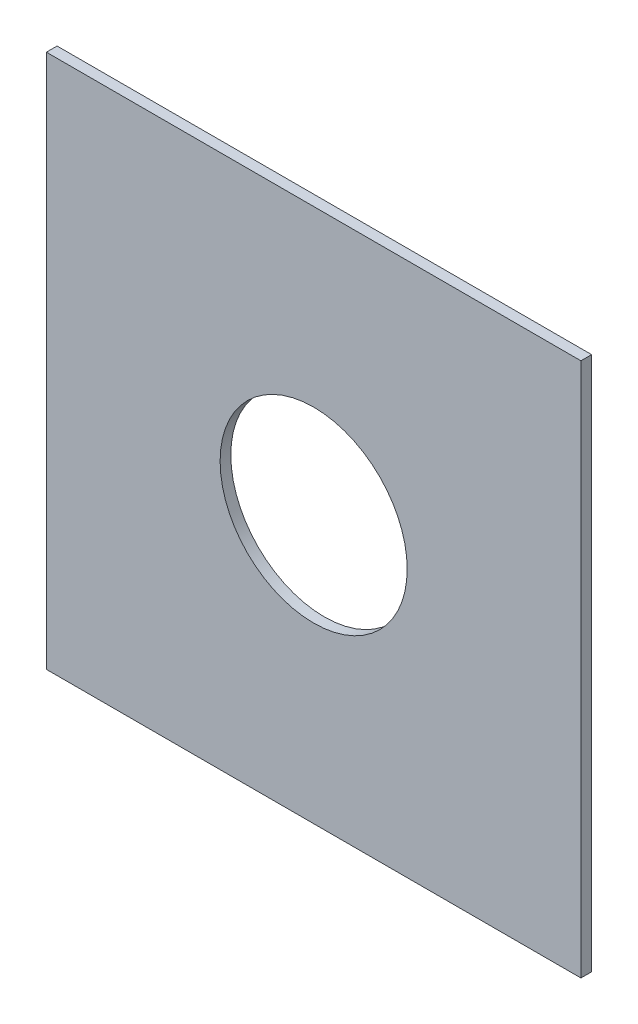
ISO-10303-21;
HEADER;
FILE_DESCRIPTION(('STEP AP214'),'2;1');
FILE_NAME('part.step','',(''),(''),'','','');
FILE_SCHEMA(('AUTOMOTIVE_DESIGN { 1 0 10303 214 1 1 1 1 }'));
ENDSEC;
DATA;
#1=APPLICATION_CONTEXT('core data for automotive mechanical design processes');
#2=APPLICATION_PROTOCOL_DEFINITION('international standard','automotive_design',2000,#1);
#3=PRODUCT_CONTEXT('',#1,'mechanical');
#4=PRODUCT('Part','Part','',(#3));
#5=PRODUCT_RELATED_PRODUCT_CATEGORY('part','',(#4));
#6=PRODUCT_DEFINITION_FORMATION('','',#4);
#7=PRODUCT_DEFINITION_CONTEXT('part definition',#1,'design');
#8=PRODUCT_DEFINITION('design','',#6,#7);
#9=PRODUCT_DEFINITION_SHAPE('','',#8);
#10=(LENGTH_UNIT() NAMED_UNIT(*) SI_UNIT(.MILLI.,.METRE.));
#11=(NAMED_UNIT(*) PLANE_ANGLE_UNIT() SI_UNIT($,.RADIAN.));
#12=(NAMED_UNIT(*) SI_UNIT($,.STERADIAN.) SOLID_ANGLE_UNIT());
#13=UNCERTAINTY_MEASURE_WITH_UNIT(LENGTH_MEASURE(1.E-05),#10,'distance_accuracy_value','');
#14=(GEOMETRIC_REPRESENTATION_CONTEXT(3) GLOBAL_UNCERTAINTY_ASSIGNED_CONTEXT((#13)) GLOBAL_UNIT_ASSIGNED_CONTEXT((#10,
#11,#12)) REPRESENTATION_CONTEXT('',''));
#15=CARTESIAN_POINT('',(0.,0.,0.));
#16=DIRECTION('',(0.,0.,1.));
#17=DIRECTION('',(1.,0.,0.));
#18=AXIS2_PLACEMENT_3D('',#15,#16,#17);
#19=CARTESIAN_POINT('',(0.,0.,2.));
#20=DIRECTION('',(0.,0.,1.));
#21=DIRECTION('',(1.,0.,0.));
#22=AXIS2_PLACEMENT_3D('',#19,#20,#21);
#23=PLANE('',#22);
#24=DIRECTION('',(0.,-1.,0.));
#25=VECTOR('',#24,1.);
#26=CARTESIAN_POINT('',(-309.301545348096,-98.5737043222271,2.));
#27=LINE('',#26,#25);
#28=CARTESIAN_POINT('',(-309.301545348096,-98.5737043222271,2.));
#29=VERTEX_POINT('',#28);
#30=CARTESIAN_POINT('',(-309.301545348096,-198.573704322227,2.));
#31=VERTEX_POINT('',#30);
#32=EDGE_CURVE('E85',#29,#31,#27,.T.);
#33=ORIENTED_EDGE('',*,*,#32,.T.);
#34=DIRECTION('',(1.,0.,0.));
#35=VECTOR('',#34,1.);
#36=CARTESIAN_POINT('',(-309.301545348096,-198.573704322227,2.));
#37=LINE('',#36,#35);
#38=CARTESIAN_POINT('',(-209.301545348096,-198.573704322227,2.));
#39=VERTEX_POINT('',#38);
#40=EDGE_CURVE('E80',#31,#39,#37,.T.);
#41=ORIENTED_EDGE('',*,*,#40,.T.);
#42=DIRECTION('',(0.,1.,0.));
#43=VECTOR('',#42,1.);
#44=CARTESIAN_POINT('',(-209.301545348096,-98.5737043222271,2.));
#45=LINE('',#44,#43);
#46=CARTESIAN_POINT('',(-209.301545348096,-98.5737043222271,2.));
#47=VERTEX_POINT('',#46);
#48=EDGE_CURVE('E83',#39,#47,#45,.T.);
#49=ORIENTED_EDGE('',*,*,#48,.T.);
#50=DIRECTION('',(-1.,0.,0.));
#51=VECTOR('',#50,1.);
#52=CARTESIAN_POINT('',(-309.301545348096,-98.5737043222271,2.));
#53=LINE('',#52,#51);
#54=EDGE_CURVE('E50',#47,#29,#53,.T.);
#55=ORIENTED_EDGE('',*,*,#54,.T.);
#56=EDGE_LOOP('',(#33,#41,#49,#55));
#57=FACE_BOUND('',#56,.T.);
#58=CARTESIAN_POINT('',(-259.301545348096,-148.573704322227,2.));
#59=DIRECTION('',(0.,0.,1.));
#60=DIRECTION('',(1.,0.,0.));
#61=AXIS2_PLACEMENT_3D('',#58,#59,#60);
#62=CIRCLE('',#61,17.5);
#63=CARTESIAN_POINT('',(-241.801545348096,-148.573704322227,2.));
#64=VERTEX_POINT('',#63);
#65=EDGE_CURVE('E100',#64,#64,#62,.T.);
#66=ORIENTED_EDGE('',*,*,#65,.F.);
#67=EDGE_LOOP('',(#66));
#68=FACE_BOUND('',#67,.T.);
#69=ADVANCED_FACE('F33',(#57,#68),#23,.T.);
#70=CARTESIAN_POINT('',(0.,0.,0.));
#71=DIRECTION('',(0.,0.,1.));
#72=DIRECTION('',(1.,0.,0.));
#73=AXIS2_PLACEMENT_3D('',#70,#71,#72);
#74=PLANE('',#73);
#75=DIRECTION('',(0.,-1.,0.));
#76=VECTOR('',#75,1.);
#77=CARTESIAN_POINT('',(-309.301545348096,-98.5737043222271,0.));
#78=LINE('',#77,#76);
#79=CARTESIAN_POINT('',(-309.301545348096,-98.5737043222271,0.));
#80=VERTEX_POINT('',#79);
#81=CARTESIAN_POINT('',(-309.301545348096,-198.573704322227,0.));
#82=VERTEX_POINT('',#81);
#83=EDGE_CURVE('E97',#80,#82,#78,.T.);
#84=ORIENTED_EDGE('',*,*,#83,.F.);
#85=DIRECTION('',(-1.,0.,0.));
#86=VECTOR('',#85,1.);
#87=CARTESIAN_POINT('',(-309.301545348096,-98.5737043222271,0.));
#88=LINE('',#87,#86);
#89=CARTESIAN_POINT('',(-209.301545348096,-98.5737043222271,0.));
#90=VERTEX_POINT('',#89);
#91=EDGE_CURVE('E73',#90,#80,#88,.T.);
#92=ORIENTED_EDGE('',*,*,#91,.F.);
#93=DIRECTION('',(0.,1.,0.));
#94=VECTOR('',#93,1.);
#95=CARTESIAN_POINT('',(-209.301545348096,-98.5737043222271,0.));
#96=LINE('',#95,#94);
#97=CARTESIAN_POINT('',(-209.301545348096,-198.573704322227,0.));
#98=VERTEX_POINT('',#97);
#99=EDGE_CURVE('E67',#98,#90,#96,.T.);
#100=ORIENTED_EDGE('',*,*,#99,.F.);
#101=DIRECTION('',(1.,0.,0.));
#102=VECTOR('',#101,1.);
#103=CARTESIAN_POINT('',(-309.301545348096,-198.573704322227,0.));
#104=LINE('',#103,#102);
#105=EDGE_CURVE('E89',#82,#98,#104,.T.);
#106=ORIENTED_EDGE('',*,*,#105,.F.);
#107=EDGE_LOOP('',(#84,#92,#100,#106));
#108=FACE_BOUND('',#107,.T.);
#109=CARTESIAN_POINT('',(-259.301545348096,-148.573704322227,0.));
#110=DIRECTION('',(0.,0.,1.));
#111=DIRECTION('',(1.,0.,0.));
#112=AXIS2_PLACEMENT_3D('',#109,#110,#111);
#113=CIRCLE('',#112,17.5);
#114=CARTESIAN_POINT('',(-241.801545348096,-148.573704322227,0.));
#115=VERTEX_POINT('',#114);
#116=EDGE_CURVE('E112',#115,#115,#113,.T.);
#117=ORIENTED_EDGE('',*,*,#116,.T.);
#118=EDGE_LOOP('',(#117));
#119=FACE_BOUND('',#118,.T.);
#120=ADVANCED_FACE('F108',(#108,#119),#74,.F.);
#121=CARTESIAN_POINT('',(-309.301545348096,-98.5737043222271,2.));
#122=DIRECTION('',(1.,0.,0.));
#123=DIRECTION('',(0.,1.,0.));
#124=AXIS2_PLACEMENT_3D('',#121,#122,#123);
#125=PLANE('',#124);
#126=ORIENTED_EDGE('',*,*,#83,.T.);
#127=DIRECTION('',(0.,0.,-1.));
#128=VECTOR('',#127,1.);
#129=CARTESIAN_POINT('',(-309.301545348096,-198.573704322227,2.));
#130=LINE('',#129,#128);
#131=EDGE_CURVE('E11',#31,#82,#130,.T.);
#132=ORIENTED_EDGE('',*,*,#131,.F.);
#133=ORIENTED_EDGE('',*,*,#32,.F.);
#134=DIRECTION('',(0.,0.,-1.));
#135=VECTOR('',#134,1.);
#136=CARTESIAN_POINT('',(-309.301545348096,-98.5737043222271,2.));
#137=LINE('',#136,#135);
#138=EDGE_CURVE('E93',#29,#80,#137,.T.);
#139=ORIENTED_EDGE('',*,*,#138,.T.);
#140=EDGE_LOOP('',(#126,#132,#133,#139));
#141=FACE_BOUND('',#140,.T.);
#142=ADVANCED_FACE('F35',(#141),#125,.F.);
#143=CARTESIAN_POINT('',(-309.301545348096,-198.573704322227,2.));
#144=DIRECTION('',(0.,1.,0.));
#145=DIRECTION('',(0.,0.,1.));
#146=AXIS2_PLACEMENT_3D('',#143,#144,#145);
#147=PLANE('',#146);
#148=ORIENTED_EDGE('',*,*,#105,.T.);
#149=DIRECTION('',(0.,0.,-1.));
#150=VECTOR('',#149,1.);
#151=CARTESIAN_POINT('',(-209.301545348096,-198.573704322227,2.));
#152=LINE('',#151,#150);
#153=EDGE_CURVE('E42',#39,#98,#152,.T.);
#154=ORIENTED_EDGE('',*,*,#153,.F.);
#155=ORIENTED_EDGE('',*,*,#40,.F.);
#156=ORIENTED_EDGE('',*,*,#131,.T.);
#157=EDGE_LOOP('',(#148,#154,#155,#156));
#158=FACE_BOUND('',#157,.T.);
#159=ADVANCED_FACE('F88',(#158),#147,.F.);
#160=CARTESIAN_POINT('',(-209.301545348096,-98.5737043222271,2.));
#161=DIRECTION('',(-1.,0.,0.));
#162=DIRECTION('',(0.,-1.,0.));
#163=AXIS2_PLACEMENT_3D('',#160,#161,#162);
#164=PLANE('',#163);
#165=ORIENTED_EDGE('',*,*,#99,.T.);
#166=DIRECTION('',(0.,0.,-1.));
#167=VECTOR('',#166,1.);
#168=CARTESIAN_POINT('',(-209.301545348096,-98.5737043222271,2.));
#169=LINE('',#168,#167);
#170=EDGE_CURVE('E90',#47,#90,#169,.T.);
#171=ORIENTED_EDGE('',*,*,#170,.F.);
#172=ORIENTED_EDGE('',*,*,#48,.F.);
#173=ORIENTED_EDGE('',*,*,#153,.T.);
#174=EDGE_LOOP('',(#165,#171,#172,#173));
#175=FACE_BOUND('',#174,.T.);
#176=ADVANCED_FACE('F91',(#175),#164,.F.);
#177=CARTESIAN_POINT('',(-309.301545348096,-98.5737043222271,2.));
#178=DIRECTION('',(0.,-1.,0.));
#179=DIRECTION('',(1.,0.,0.));
#180=AXIS2_PLACEMENT_3D('',#177,#178,#179);
#181=PLANE('',#180);
#182=ORIENTED_EDGE('',*,*,#91,.T.);
#183=ORIENTED_EDGE('',*,*,#138,.F.);
#184=ORIENTED_EDGE('',*,*,#54,.F.);
#185=ORIENTED_EDGE('',*,*,#170,.T.);
#186=EDGE_LOOP('',(#182,#183,#184,#185));
#187=FACE_BOUND('',#186,.T.);
#188=ADVANCED_FACE('F105',(#187),#181,.F.);
#189=CARTESIAN_POINT('',(-259.301545348096,-148.573704322227,2.));
#190=DIRECTION('',(0.,0.,-1.));
#191=DIRECTION('',(-1.,0.,0.));
#192=AXIS2_PLACEMENT_3D('',#189,#190,#191);
#193=CYLINDRICAL_SURFACE('',#192,17.5);
#194=ORIENTED_EDGE('',*,*,#65,.T.);
#195=EDGE_LOOP('',(#194));
#196=FACE_BOUND('',#195,.T.);
#197=ORIENTED_EDGE('',*,*,#116,.F.);
#198=EDGE_LOOP('',(#197));
#199=FACE_BOUND('',#198,.T.);
#200=ADVANCED_FACE('F118',(#196,#199),#193,.F.);
#201=CLOSED_SHELL('',(#69,#120,#142,#159,#176,#188,#200));
#202=MANIFOLD_SOLID_BREP('B2',#201);
#203=ADVANCED_BREP_SHAPE_REPRESENTATION('',(#18,#202),#14);
#204=SHAPE_DEFINITION_REPRESENTATION(#9,#203);
ENDSEC;
END-ISO-10303-21;
